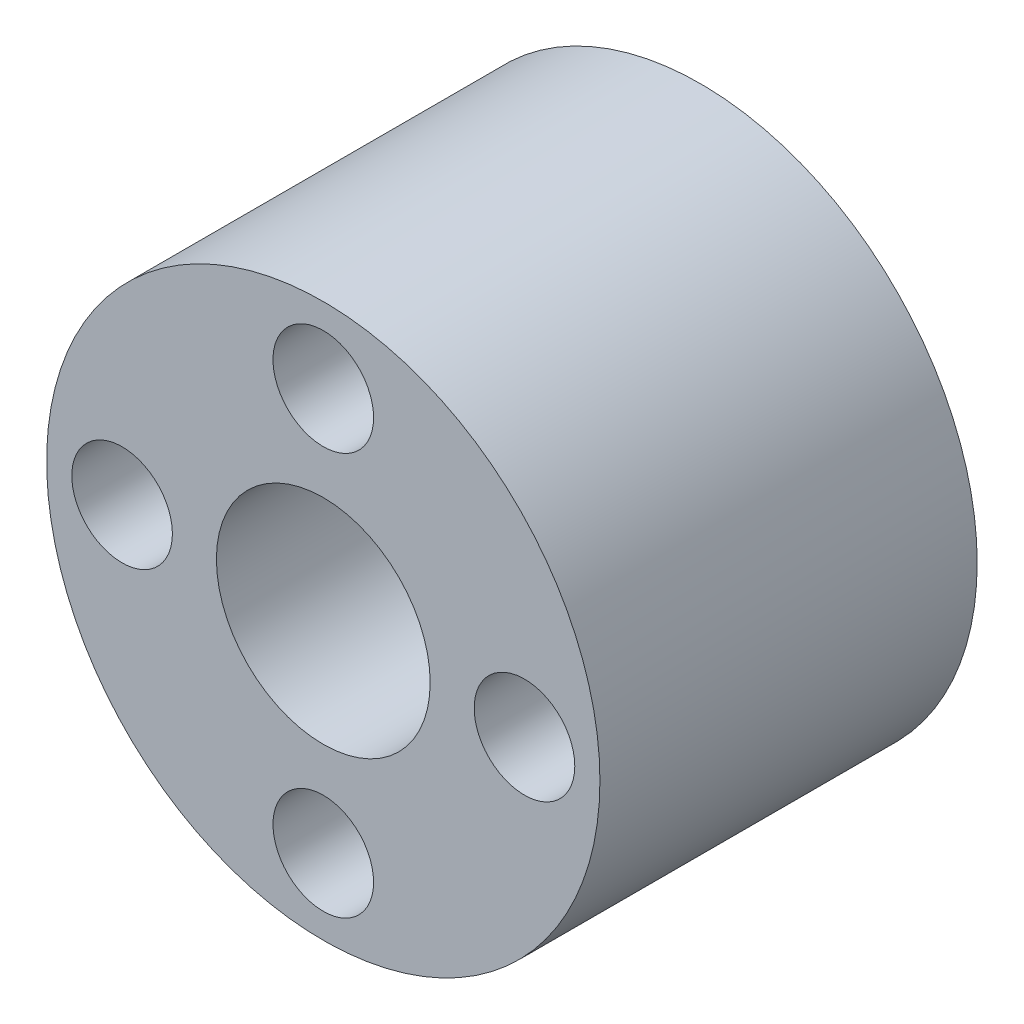
ISO-10303-21;
HEADER;
FILE_DESCRIPTION(('STEP AP214'),'2;1');
FILE_NAME('part.step','',(''),(''),'','','');
FILE_SCHEMA(('AUTOMOTIVE_DESIGN { 1 0 10303 214 1 1 1 1 }'));
ENDSEC;
DATA;
#1=APPLICATION_CONTEXT('core data for automotive mechanical design processes');
#2=APPLICATION_PROTOCOL_DEFINITION('international standard','automotive_design',2000,#1);
#3=PRODUCT_CONTEXT('',#1,'mechanical');
#4=PRODUCT('Part','Part','',(#3));
#5=PRODUCT_RELATED_PRODUCT_CATEGORY('part','',(#4));
#6=PRODUCT_DEFINITION_FORMATION('','',#4);
#7=PRODUCT_DEFINITION_CONTEXT('part definition',#1,'design');
#8=PRODUCT_DEFINITION('design','',#6,#7);
#9=PRODUCT_DEFINITION_SHAPE('','',#8);
#10=(LENGTH_UNIT() NAMED_UNIT(*) SI_UNIT(.MILLI.,.METRE.));
#11=(NAMED_UNIT(*) PLANE_ANGLE_UNIT() SI_UNIT($,.RADIAN.));
#12=(NAMED_UNIT(*) SI_UNIT($,.STERADIAN.) SOLID_ANGLE_UNIT());
#13=UNCERTAINTY_MEASURE_WITH_UNIT(LENGTH_MEASURE(1.E-05),#10,'distance_accuracy_value','');
#14=(GEOMETRIC_REPRESENTATION_CONTEXT(3) GLOBAL_UNCERTAINTY_ASSIGNED_CONTEXT((#13)) GLOBAL_UNIT_ASSIGNED_CONTEXT((#10,
#11,#12)) REPRESENTATION_CONTEXT('',''));
#15=CARTESIAN_POINT('',(0.,0.,0.));
#16=DIRECTION('',(0.,0.,1.));
#17=DIRECTION('',(1.,0.,0.));
#18=AXIS2_PLACEMENT_3D('',#15,#16,#17);
#19=CARTESIAN_POINT('',(0.,0.,0.));
#20=DIRECTION('',(0.,0.,1.));
#21=DIRECTION('',(1.,0.,0.));
#22=AXIS2_PLACEMENT_3D('',#19,#20,#21);
#23=PLANE('',#22);
#24=CARTESIAN_POINT('',(-7.99999999999977,-2.26883816723573E-13,0.));
#25=DIRECTION('',(0.,0.,1.));
#26=DIRECTION('',(1.,0.,0.));
#27=AXIS2_PLACEMENT_3D('',#24,#25,#26);
#28=CIRCLE('',#27,2.00000000000036);
#29=CARTESIAN_POINT('',(-5.99999999999941,-2.26883816723573E-13,0.));
#30=VERTEX_POINT('',#29);
#31=EDGE_CURVE('E56',#30,#30,#28,.T.);
#32=ORIENTED_EDGE('',*,*,#31,.T.);
#33=EDGE_LOOP('',(#32));
#34=FACE_BOUND('',#33,.T.);
#35=CARTESIAN_POINT('',(0.,8.,0.));
#36=DIRECTION('',(0.,0.,1.));
#37=DIRECTION('',(1.,0.,0.));
#38=AXIS2_PLACEMENT_3D('',#35,#36,#37);
#39=CIRCLE('',#38,2.);
#40=CARTESIAN_POINT('',(2.,8.,0.));
#41=VERTEX_POINT('',#40);
#42=EDGE_CURVE('E79',#41,#41,#39,.T.);
#43=ORIENTED_EDGE('',*,*,#42,.T.);
#44=EDGE_LOOP('',(#43));
#45=FACE_BOUND('',#44,.T.);
#46=CARTESIAN_POINT('',(8.00000000000023,2.25904099284255E-13,0.));
#47=DIRECTION('',(0.,0.,1.));
#48=DIRECTION('',(1.,0.,0.));
#49=AXIS2_PLACEMENT_3D('',#46,#47,#48);
#50=CIRCLE('',#49,2.00000000000018);
#51=CARTESIAN_POINT('',(10.0000000000004,2.25904099284255E-13,0.));
#52=VERTEX_POINT('',#51);
#53=EDGE_CURVE('E71',#52,#52,#50,.T.);
#54=ORIENTED_EDGE('',*,*,#53,.T.);
#55=EDGE_LOOP('',(#54));
#56=FACE_BOUND('',#55,.T.);
#57=CARTESIAN_POINT('',(4.51808198568511E-13,-8.,0.));
#58=DIRECTION('',(0.,0.,1.));
#59=DIRECTION('',(1.,0.,0.));
#60=AXIS2_PLACEMENT_3D('',#57,#58,#59);
#61=CIRCLE('',#60,2.00000000000049);
#62=CARTESIAN_POINT('',(2.00000000000094,-8.,0.));
#63=VERTEX_POINT('',#62);
#64=EDGE_CURVE('E62',#63,#63,#61,.T.);
#65=ORIENTED_EDGE('',*,*,#64,.T.);
#66=EDGE_LOOP('',(#65));
#67=FACE_BOUND('',#66,.T.);
#68=CARTESIAN_POINT('',(0.,0.,0.));
#69=DIRECTION('',(0.,0.,1.));
#70=DIRECTION('',(1.,0.,0.));
#71=AXIS2_PLACEMENT_3D('',#68,#69,#70);
#72=CIRCLE('',#71,11.);
#73=CARTESIAN_POINT('',(11.,0.,0.));
#74=VERTEX_POINT('',#73);
#75=EDGE_CURVE('E47',#74,#74,#72,.T.);
#76=ORIENTED_EDGE('',*,*,#75,.F.);
#77=EDGE_LOOP('',(#76));
#78=FACE_BOUND('',#77,.T.);
#79=ADVANCED_FACE('F43',(#34,#45,#56,#67,#78),#23,.F.);
#80=CARTESIAN_POINT('',(0.,0.,15.));
#81=DIRECTION('',(0.,0.,-1.));
#82=DIRECTION('',(-1.,0.,0.));
#83=AXIS2_PLACEMENT_3D('',#80,#81,#82);
#84=CYLINDRICAL_SURFACE('',#83,11.);
#85=CARTESIAN_POINT('',(0.,0.,15.));
#86=DIRECTION('',(0.,0.,1.));
#87=DIRECTION('',(1.,0.,0.));
#88=AXIS2_PLACEMENT_3D('',#85,#86,#87);
#89=CIRCLE('',#88,11.);
#90=CARTESIAN_POINT('',(11.,0.,15.));
#91=VERTEX_POINT('',#90);
#92=EDGE_CURVE('E11',#91,#91,#89,.T.);
#93=ORIENTED_EDGE('',*,*,#92,.F.);
#94=EDGE_LOOP('',(#93));
#95=FACE_BOUND('',#94,.T.);
#96=ORIENTED_EDGE('',*,*,#75,.T.);
#97=EDGE_LOOP('',(#96));
#98=FACE_BOUND('',#97,.T.);
#99=ADVANCED_FACE('F45',(#95,#98),#84,.T.);
#100=CARTESIAN_POINT('',(0.,0.,15.));
#101=DIRECTION('',(0.,0.,1.));
#102=DIRECTION('',(1.,0.,0.));
#103=AXIS2_PLACEMENT_3D('',#100,#101,#102);
#104=PLANE('',#103);
#105=CARTESIAN_POINT('',(0.,0.,15.));
#106=DIRECTION('',(0.,0.,1.));
#107=DIRECTION('',(1.,0.,0.));
#108=AXIS2_PLACEMENT_3D('',#105,#106,#107);
#109=CIRCLE('',#108,4.25);
#110=CARTESIAN_POINT('',(4.25,0.,15.));
#111=VERTEX_POINT('',#110);
#112=EDGE_CURVE('E90',#111,#111,#109,.T.);
#113=ORIENTED_EDGE('',*,*,#112,.F.);
#114=EDGE_LOOP('',(#113));
#115=FACE_BOUND('',#114,.T.);
#116=CARTESIAN_POINT('',(-7.99999999999977,-2.26883816723573E-13,15.));
#117=DIRECTION('',(0.,0.,1.));
#118=DIRECTION('',(1.,0.,0.));
#119=AXIS2_PLACEMENT_3D('',#116,#117,#118);
#120=CIRCLE('',#119,2.00000000000036);
#121=CARTESIAN_POINT('',(-5.99999999999941,-2.26883816723573E-13,15.));
#122=VERTEX_POINT('',#121);
#123=EDGE_CURVE('E83',#122,#122,#120,.T.);
#124=ORIENTED_EDGE('',*,*,#123,.F.);
#125=EDGE_LOOP('',(#124));
#126=FACE_BOUND('',#125,.T.);
#127=CARTESIAN_POINT('',(0.,8.,15.));
#128=DIRECTION('',(0.,0.,1.));
#129=DIRECTION('',(1.,0.,0.));
#130=AXIS2_PLACEMENT_3D('',#127,#128,#129);
#131=CIRCLE('',#130,2.);
#132=CARTESIAN_POINT('',(2.,8.,15.));
#133=VERTEX_POINT('',#132);
#134=EDGE_CURVE('E75',#133,#133,#131,.T.);
#135=ORIENTED_EDGE('',*,*,#134,.F.);
#136=EDGE_LOOP('',(#135));
#137=FACE_BOUND('',#136,.T.);
#138=CARTESIAN_POINT('',(8.00000000000023,2.25904099284255E-13,15.));
#139=DIRECTION('',(0.,0.,1.));
#140=DIRECTION('',(1.,0.,0.));
#141=AXIS2_PLACEMENT_3D('',#138,#139,#140);
#142=CIRCLE('',#141,2.00000000000018);
#143=CARTESIAN_POINT('',(10.0000000000004,2.25904099284255E-13,15.));
#144=VERTEX_POINT('',#143);
#145=EDGE_CURVE('E67',#144,#144,#142,.T.);
#146=ORIENTED_EDGE('',*,*,#145,.F.);
#147=EDGE_LOOP('',(#146));
#148=FACE_BOUND('',#147,.T.);
#149=CARTESIAN_POINT('',(4.51808198568511E-13,-8.,15.));
#150=DIRECTION('',(0.,0.,1.));
#151=DIRECTION('',(1.,0.,0.));
#152=AXIS2_PLACEMENT_3D('',#149,#150,#151);
#153=CIRCLE('',#152,2.00000000000049);
#154=CARTESIAN_POINT('',(2.00000000000094,-8.,15.));
#155=VERTEX_POINT('',#154);
#156=EDGE_CURVE('E58',#155,#155,#153,.T.);
#157=ORIENTED_EDGE('',*,*,#156,.F.);
#158=EDGE_LOOP('',(#157));
#159=FACE_BOUND('',#158,.T.);
#160=ORIENTED_EDGE('',*,*,#92,.T.);
#161=EDGE_LOOP('',(#160));
#162=FACE_BOUND('',#161,.T.);
#163=ADVANCED_FACE('F107',(#115,#126,#137,#148,#159,#162),#104,.T.);
#164=CARTESIAN_POINT('',(4.51808198568511E-13,-8.,0.));
#165=DIRECTION('',(0.,0.,1.));
#166=DIRECTION('',(1.,0.,0.));
#167=AXIS2_PLACEMENT_3D('',#164,#165,#166);
#168=CYLINDRICAL_SURFACE('',#167,2.00000000000049);
#169=ORIENTED_EDGE('',*,*,#64,.F.);
#170=EDGE_LOOP('',(#169));
#171=FACE_BOUND('',#170,.T.);
#172=ORIENTED_EDGE('',*,*,#156,.T.);
#173=EDGE_LOOP('',(#172));
#174=FACE_BOUND('',#173,.T.);
#175=ADVANCED_FACE('F110',(#171,#174),#168,.F.);
#176=CARTESIAN_POINT('',(8.00000000000023,2.25904099284255E-13,0.));
#177=DIRECTION('',(0.,0.,1.));
#178=DIRECTION('',(1.,0.,0.));
#179=AXIS2_PLACEMENT_3D('',#176,#177,#178);
#180=CYLINDRICAL_SURFACE('',#179,2.00000000000018);
#181=ORIENTED_EDGE('',*,*,#53,.F.);
#182=EDGE_LOOP('',(#181));
#183=FACE_BOUND('',#182,.T.);
#184=ORIENTED_EDGE('',*,*,#145,.T.);
#185=EDGE_LOOP('',(#184));
#186=FACE_BOUND('',#185,.T.);
#187=ADVANCED_FACE('F121',(#183,#186),#180,.F.);
#188=CARTESIAN_POINT('',(0.,8.,0.));
#189=DIRECTION('',(0.,0.,1.));
#190=DIRECTION('',(1.,0.,0.));
#191=AXIS2_PLACEMENT_3D('',#188,#189,#190);
#192=CYLINDRICAL_SURFACE('',#191,2.);
#193=ORIENTED_EDGE('',*,*,#42,.F.);
#194=EDGE_LOOP('',(#193));
#195=FACE_BOUND('',#194,.T.);
#196=ORIENTED_EDGE('',*,*,#134,.T.);
#197=EDGE_LOOP('',(#196));
#198=FACE_BOUND('',#197,.T.);
#199=ADVANCED_FACE('F127',(#195,#198),#192,.F.);
#200=CARTESIAN_POINT('',(-7.99999999999977,-2.26883816723573E-13,0.));
#201=DIRECTION('',(0.,0.,1.));
#202=DIRECTION('',(1.,0.,0.));
#203=AXIS2_PLACEMENT_3D('',#200,#201,#202);
#204=CYLINDRICAL_SURFACE('',#203,2.00000000000036);
#205=ORIENTED_EDGE('',*,*,#31,.F.);
#206=EDGE_LOOP('',(#205));
#207=FACE_BOUND('',#206,.T.);
#208=ORIENTED_EDGE('',*,*,#123,.T.);
#209=EDGE_LOOP('',(#208));
#210=FACE_BOUND('',#209,.T.);
#211=ADVANCED_FACE('F103',(#207,#210),#204,.F.);
#212=CARTESIAN_POINT('',(0.,0.,5.));
#213=DIRECTION('',(0.,0.,1.));
#214=DIRECTION('',(1.,0.,0.));
#215=AXIS2_PLACEMENT_3D('',#212,#213,#214);
#216=CYLINDRICAL_SURFACE('',#215,4.25);
#217=CARTESIAN_POINT('',(0.,0.,5.));
#218=DIRECTION('',(0.,0.,1.));
#219=DIRECTION('',(1.,0.,0.));
#220=AXIS2_PLACEMENT_3D('',#217,#218,#219);
#221=CIRCLE('',#220,4.25);
#222=CARTESIAN_POINT('',(4.25,0.,5.));
#223=VERTEX_POINT('',#222);
#224=EDGE_CURVE('E63',#223,#223,#221,.T.);
#225=ORIENTED_EDGE('',*,*,#224,.F.);
#226=EDGE_LOOP('',(#225));
#227=FACE_BOUND('',#226,.T.);
#228=ORIENTED_EDGE('',*,*,#112,.T.);
#229=EDGE_LOOP('',(#228));
#230=FACE_BOUND('',#229,.T.);
#231=ADVANCED_FACE('F100',(#227,#230),#216,.F.);
#232=CARTESIAN_POINT('',(0.,0.,5.));
#233=DIRECTION('',(0.,0.,1.));
#234=DIRECTION('',(1.,0.,0.));
#235=AXIS2_PLACEMENT_3D('',#232,#233,#234);
#236=PLANE('',#235);
#237=ORIENTED_EDGE('',*,*,#224,.T.);
#238=EDGE_LOOP('',(#237));
#239=FACE_BOUND('',#238,.T.);
#240=ADVANCED_FACE('F98',(#239),#236,.T.);
#241=CLOSED_SHELL('',(#79,#99,#163,#175,#187,#199,#211,#231,#240));
#242=MANIFOLD_SOLID_BREP('B2',#241);
#243=ADVANCED_BREP_SHAPE_REPRESENTATION('',(#18,#242),#14);
#244=SHAPE_DEFINITION_REPRESENTATION(#9,#243);
ENDSEC;
END-ISO-10303-21;
